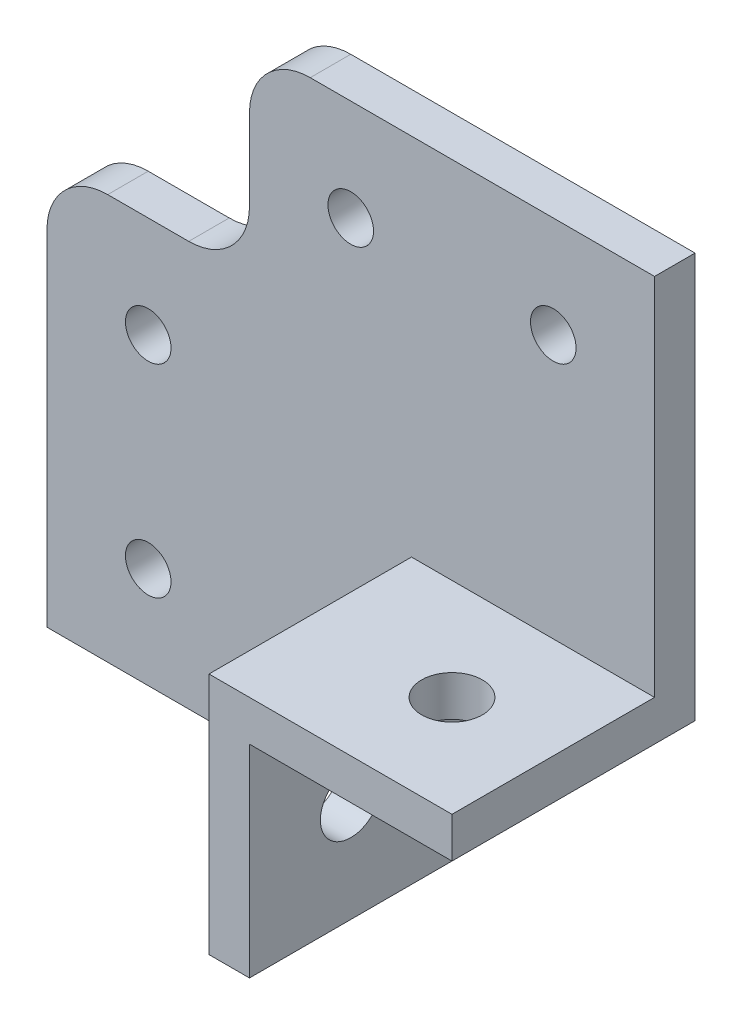
ISO-10303-21;
HEADER;
FILE_DESCRIPTION(('STEP AP214'),'2;1');
FILE_NAME('part.step','',(''),(''),'','','');
FILE_SCHEMA(('AUTOMOTIVE_DESIGN { 1 0 10303 214 1 1 1 1 }'));
ENDSEC;
DATA;
#1=APPLICATION_CONTEXT('core data for automotive mechanical design processes');
#2=APPLICATION_PROTOCOL_DEFINITION('international standard','automotive_design',2000,#1);
#3=PRODUCT_CONTEXT('',#1,'mechanical');
#4=PRODUCT('Part','Part','',(#3));
#5=PRODUCT_RELATED_PRODUCT_CATEGORY('part','',(#4));
#6=PRODUCT_DEFINITION_FORMATION('','',#4);
#7=PRODUCT_DEFINITION_CONTEXT('part definition',#1,'design');
#8=PRODUCT_DEFINITION('design','',#6,#7);
#9=PRODUCT_DEFINITION_SHAPE('','',#8);
#10=(LENGTH_UNIT() NAMED_UNIT(*) SI_UNIT(.MILLI.,.METRE.));
#11=(NAMED_UNIT(*) PLANE_ANGLE_UNIT() SI_UNIT($,.RADIAN.));
#12=(NAMED_UNIT(*) SI_UNIT($,.STERADIAN.) SOLID_ANGLE_UNIT());
#13=UNCERTAINTY_MEASURE_WITH_UNIT(LENGTH_MEASURE(1.E-05),#10,'distance_accuracy_value','');
#14=(GEOMETRIC_REPRESENTATION_CONTEXT(3) GLOBAL_UNCERTAINTY_ASSIGNED_CONTEXT((#13)) GLOBAL_UNIT_ASSIGNED_CONTEXT((#10,
#11,#12)) REPRESENTATION_CONTEXT('',''));
#15=CARTESIAN_POINT('',(0.,0.,0.));
#16=DIRECTION('',(0.,0.,1.));
#17=DIRECTION('',(1.,0.,0.));
#18=AXIS2_PLACEMENT_3D('',#15,#16,#17);
#19=CARTESIAN_POINT('',(20.,60.,4.));
#20=DIRECTION('',(0.,-1.,0.));
#21=DIRECTION('',(1.,0.,0.));
#22=AXIS2_PLACEMENT_3D('',#19,#20,#21);
#23=PLANE('',#22);
#24=DIRECTION('',(-1.,0.,0.));
#25=VECTOR('',#24,1.);
#26=CARTESIAN_POINT('',(20.,60.,0.));
#27=LINE('',#26,#25);
#28=CARTESIAN_POINT('',(20.,60.,0.));
#29=VERTEX_POINT('',#28);
#30=CARTESIAN_POINT('',(-14.,60.,0.));
#31=VERTEX_POINT('',#30);
#32=EDGE_CURVE('E228',#29,#31,#27,.T.);
#33=ORIENTED_EDGE('',*,*,#32,.T.);
#34=DIRECTION('',(0.,0.,-1.));
#35=VECTOR('',#34,1.);
#36=CARTESIAN_POINT('',(-14.,60.,4.));
#37=LINE('',#36,#35);
#38=CARTESIAN_POINT('',(-14.,60.,4.));
#39=VERTEX_POINT('',#38);
#40=EDGE_CURVE('E55',#31,#39,#37,.F.);
#41=ORIENTED_EDGE('',*,*,#40,.T.);
#42=DIRECTION('',(-1.,0.,0.));
#43=VECTOR('',#42,1.);
#44=CARTESIAN_POINT('',(20.,60.,4.));
#45=LINE('',#44,#43);
#46=CARTESIAN_POINT('',(20.,60.,4.));
#47=VERTEX_POINT('',#46);
#48=EDGE_CURVE('E243',#47,#39,#45,.T.);
#49=ORIENTED_EDGE('',*,*,#48,.F.);
#50=DIRECTION('',(0.,0.,-1.));
#51=VECTOR('',#50,1.);
#52=CARTESIAN_POINT('',(20.,60.,4.));
#53=LINE('',#52,#51);
#54=EDGE_CURVE('E146',#47,#29,#53,.T.);
#55=ORIENTED_EDGE('',*,*,#54,.T.);
#56=EDGE_LOOP('',(#33,#41,#49,#55));
#57=FACE_BOUND('',#56,.T.);
#58=ADVANCED_FACE('F32',(#57),#23,.F.);
#59=CARTESIAN_POINT('',(-20.,60.,4.));
#60=DIRECTION('',(1.,0.,0.));
#61=DIRECTION('',(0.,0.,-1.));
#62=AXIS2_PLACEMENT_3D('',#59,#60,#61);
#63=PLANE('',#62);
#64=DIRECTION('',(0.,-1.,0.));
#65=VECTOR('',#64,1.);
#66=CARTESIAN_POINT('',(-20.,60.,0.));
#67=LINE('',#66,#65);
#68=CARTESIAN_POINT('',(-20.,54.,0.));
#69=VERTEX_POINT('',#68);
#70=CARTESIAN_POINT('',(-20.,46.,0.));
#71=VERTEX_POINT('',#70);
#72=EDGE_CURVE('E217',#69,#71,#67,.T.);
#73=ORIENTED_EDGE('',*,*,#72,.T.);
#74=DIRECTION('',(0.,0.,-1.));
#75=VECTOR('',#74,1.);
#76=CARTESIAN_POINT('',(-20.,46.,4.));
#77=LINE('',#76,#75);
#78=CARTESIAN_POINT('',(-20.,46.,4.));
#79=VERTEX_POINT('',#78);
#80=EDGE_CURVE('E200',#71,#79,#77,.F.);
#81=ORIENTED_EDGE('',*,*,#80,.T.);
#82=DIRECTION('',(0.,-1.,0.));
#83=VECTOR('',#82,1.);
#84=CARTESIAN_POINT('',(-20.,60.,4.));
#85=LINE('',#84,#83);
#86=CARTESIAN_POINT('',(-20.,54.,4.));
#87=VERTEX_POINT('',#86);
#88=EDGE_CURVE('E235',#87,#79,#85,.T.);
#89=ORIENTED_EDGE('',*,*,#88,.F.);
#90=DIRECTION('',(0.,0.,-1.));
#91=VECTOR('',#90,1.);
#92=CARTESIAN_POINT('',(-20.,54.,4.));
#93=LINE('',#92,#91);
#94=EDGE_CURVE('E197',#87,#69,#93,.T.);
#95=ORIENTED_EDGE('',*,*,#94,.T.);
#96=EDGE_LOOP('',(#73,#81,#89,#95));
#97=FACE_BOUND('',#96,.T.);
#98=ADVANCED_FACE('F224',(#97),#63,.F.);
#99=CARTESIAN_POINT('',(-20.,40.,4.));
#100=DIRECTION('',(0.,-1.,0.));
#101=DIRECTION('',(1.,0.,0.));
#102=AXIS2_PLACEMENT_3D('',#99,#100,#101);
#103=PLANE('',#102);
#104=DIRECTION('',(-1.,0.,0.));
#105=VECTOR('',#104,1.);
#106=CARTESIAN_POINT('',(-20.,40.,4.));
#107=LINE('',#106,#105);
#108=CARTESIAN_POINT('',(-26.,40.,4.));
#109=VERTEX_POINT('',#108);
#110=CARTESIAN_POINT('',(-34.,40.,4.));
#111=VERTEX_POINT('',#110);
#112=EDGE_CURVE('E234',#109,#111,#107,.T.);
#113=ORIENTED_EDGE('',*,*,#112,.F.);
#114=DIRECTION('',(0.,0.,-1.));
#115=VECTOR('',#114,1.);
#116=CARTESIAN_POINT('',(-26.,40.,0.));
#117=LINE('',#116,#115);
#118=CARTESIAN_POINT('',(-26.,40.,0.));
#119=VERTEX_POINT('',#118);
#120=EDGE_CURVE('E193',#109,#119,#117,.T.);
#121=ORIENTED_EDGE('',*,*,#120,.T.);
#122=DIRECTION('',(-1.,0.,0.));
#123=VECTOR('',#122,1.);
#124=CARTESIAN_POINT('',(-20.,40.,0.));
#125=LINE('',#124,#123);
#126=CARTESIAN_POINT('',(-34.,40.,0.));
#127=VERTEX_POINT('',#126);
#128=EDGE_CURVE('E219',#119,#127,#125,.T.);
#129=ORIENTED_EDGE('',*,*,#128,.T.);
#130=DIRECTION('',(0.,0.,-1.));
#131=VECTOR('',#130,1.);
#132=CARTESIAN_POINT('',(-34.,40.,4.));
#133=LINE('',#132,#131);
#134=EDGE_CURVE('E191',#127,#111,#133,.F.);
#135=ORIENTED_EDGE('',*,*,#134,.T.);
#136=EDGE_LOOP('',(#113,#121,#129,#135));
#137=FACE_BOUND('',#136,.T.);
#138=ADVANCED_FACE('F237',(#137),#103,.F.);
#139=CARTESIAN_POINT('',(-40.,40.,4.));
#140=DIRECTION('',(1.,0.,0.));
#141=DIRECTION('',(0.,1.,0.));
#142=AXIS2_PLACEMENT_3D('',#139,#140,#141);
#143=PLANE('',#142);
#144=DIRECTION('',(0.,-1.,0.));
#145=VECTOR('',#144,1.);
#146=CARTESIAN_POINT('',(-40.,40.,4.));
#147=LINE('',#146,#145);
#148=CARTESIAN_POINT('',(-40.,34.,4.));
#149=VERTEX_POINT('',#148);
#150=CARTESIAN_POINT('',(-40.,0.,4.));
#151=VERTEX_POINT('',#150);
#152=EDGE_CURVE('E239',#149,#151,#147,.T.);
#153=ORIENTED_EDGE('',*,*,#152,.F.);
#154=DIRECTION('',(0.,0.,-1.));
#155=VECTOR('',#154,1.);
#156=CARTESIAN_POINT('',(-40.,34.,4.));
#157=LINE('',#156,#155);
#158=CARTESIAN_POINT('',(-40.,34.,0.));
#159=VERTEX_POINT('',#158);
#160=EDGE_CURVE('E210',#149,#159,#157,.T.);
#161=ORIENTED_EDGE('',*,*,#160,.T.);
#162=DIRECTION('',(0.,-1.,0.));
#163=VECTOR('',#162,1.);
#164=CARTESIAN_POINT('',(-40.,40.,0.));
#165=LINE('',#164,#163);
#166=CARTESIAN_POINT('',(-40.,0.,0.));
#167=VERTEX_POINT('',#166);
#168=EDGE_CURVE('E291',#159,#167,#165,.T.);
#169=ORIENTED_EDGE('',*,*,#168,.T.);
#170=DIRECTION('',(0.,0.,-1.));
#171=VECTOR('',#170,1.);
#172=CARTESIAN_POINT('',(-40.,0.,4.));
#173=LINE('',#172,#171);
#174=EDGE_CURVE('E194',#151,#167,#173,.T.);
#175=ORIENTED_EDGE('',*,*,#174,.F.);
#176=EDGE_LOOP('',(#153,#161,#169,#175));
#177=FACE_BOUND('',#176,.T.);
#178=ADVANCED_FACE('F297',(#177),#143,.F.);
#179=CARTESIAN_POINT('',(-40.,0.,4.));
#180=DIRECTION('',(0.,1.,0.));
#181=DIRECTION('',(0.,0.,1.));
#182=AXIS2_PLACEMENT_3D('',#179,#180,#181);
#183=PLANE('',#182);
#184=DIRECTION('',(1.,0.,0.));
#185=VECTOR('',#184,1.);
#186=CARTESIAN_POINT('',(-40.,0.,0.));
#187=LINE('',#186,#185);
#188=CARTESIAN_POINT('',(0.,0.,0.));
#189=VERTEX_POINT('',#188);
#190=EDGE_CURVE('E288',#167,#189,#187,.T.);
#191=ORIENTED_EDGE('',*,*,#190,.T.);
#192=DIRECTION('',(0.,0.,-1.));
#193=VECTOR('',#192,1.);
#194=CARTESIAN_POINT('',(0.,0.,4.));
#195=LINE('',#194,#193);
#196=CARTESIAN_POINT('',(0.,0.,24.));
#197=VERTEX_POINT('',#196);
#198=EDGE_CURVE('E278',#197,#189,#195,.T.);
#199=ORIENTED_EDGE('',*,*,#198,.F.);
#200=DIRECTION('',(1.,0.,0.));
#201=VECTOR('',#200,1.);
#202=CARTESIAN_POINT('',(-4.,0.,24.));
#203=LINE('',#202,#201);
#204=CARTESIAN_POINT('',(-4.,0.,24.));
#205=VERTEX_POINT('',#204);
#206=EDGE_CURVE('E175',#205,#197,#203,.T.);
#207=ORIENTED_EDGE('',*,*,#206,.F.);
#208=DIRECTION('',(0.,0.,-1.));
#209=VECTOR('',#208,1.);
#210=CARTESIAN_POINT('',(-4.,0.,24.));
#211=LINE('',#210,#209);
#212=CARTESIAN_POINT('',(-4.,0.,4.));
#213=VERTEX_POINT('',#212);
#214=EDGE_CURVE('E178',#205,#213,#211,.T.);
#215=ORIENTED_EDGE('',*,*,#214,.T.);
#216=DIRECTION('',(1.,0.,0.));
#217=VECTOR('',#216,1.);
#218=CARTESIAN_POINT('',(-40.,0.,4.));
#219=LINE('',#218,#217);
#220=EDGE_CURVE('E241',#151,#213,#219,.T.);
#221=ORIENTED_EDGE('',*,*,#220,.F.);
#222=ORIENTED_EDGE('',*,*,#174,.T.);
#223=EDGE_LOOP('',(#191,#199,#207,#215,#221,#222));
#224=FACE_BOUND('',#223,.T.);
#225=ADVANCED_FACE('F287',(#224),#183,.F.);
#226=CARTESIAN_POINT('',(0.,0.,4.));
#227=DIRECTION('',(-1.,0.,0.));
#228=DIRECTION('',(0.,0.,1.));
#229=AXIS2_PLACEMENT_3D('',#226,#227,#228);
#230=PLANE('',#229);
#231=CARTESIAN_POINT('',(0.,10.,14.));
#232=DIRECTION('',(-1.,0.,0.));
#233=DIRECTION('',(0.,0.,1.));
#234=AXIS2_PLACEMENT_3D('',#231,#232,#233);
#235=CIRCLE('',#234,3.);
#236=CARTESIAN_POINT('',(0.,10.,17.));
#237=VERTEX_POINT('',#236);
#238=EDGE_CURVE('E169',#237,#237,#235,.T.);
#239=ORIENTED_EDGE('',*,*,#238,.T.);
#240=EDGE_LOOP('',(#239));
#241=FACE_BOUND('',#240,.T.);
#242=DIRECTION('',(0.,1.,0.));
#243=VECTOR('',#242,1.);
#244=CARTESIAN_POINT('',(0.,0.,0.));
#245=LINE('',#244,#243);
#246=CARTESIAN_POINT('',(0.,20.,0.));
#247=VERTEX_POINT('',#246);
#248=EDGE_CURVE('E274',#189,#247,#245,.T.);
#249=ORIENTED_EDGE('',*,*,#248,.T.);
#250=DIRECTION('',(0.,0.,-1.));
#251=VECTOR('',#250,1.);
#252=CARTESIAN_POINT('',(0.,20.,4.));
#253=LINE('',#252,#251);
#254=CARTESIAN_POINT('',(0.,20.,24.));
#255=VERTEX_POINT('',#254);
#256=EDGE_CURVE('E145',#255,#247,#253,.T.);
#257=ORIENTED_EDGE('',*,*,#256,.F.);
#258=DIRECTION('',(0.,1.,0.));
#259=VECTOR('',#258,1.);
#260=CARTESIAN_POINT('',(0.,0.,24.));
#261=LINE('',#260,#259);
#262=EDGE_CURVE('E162',#197,#255,#261,.T.);
#263=ORIENTED_EDGE('',*,*,#262,.F.);
#264=ORIENTED_EDGE('',*,*,#198,.T.);
#265=EDGE_LOOP('',(#249,#257,#263,#264));
#266=FACE_BOUND('',#265,.T.);
#267=ADVANCED_FACE('F304',(#241,#266),#230,.F.);
#268=CARTESIAN_POINT('',(0.,20.,4.));
#269=DIRECTION('',(0.,1.,0.));
#270=DIRECTION('',(0.,0.,1.));
#271=AXIS2_PLACEMENT_3D('',#268,#269,#270);
#272=PLANE('',#271);
#273=CARTESIAN_POINT('',(10.,20.,14.));
#274=DIRECTION('',(0.,1.,0.));
#275=DIRECTION('',(0.,0.,1.));
#276=AXIS2_PLACEMENT_3D('',#273,#274,#275);
#277=CIRCLE('',#276,3.);
#278=CARTESIAN_POINT('',(10.,20.,17.));
#279=VERTEX_POINT('',#278);
#280=EDGE_CURVE('E510',#279,#279,#277,.T.);
#281=ORIENTED_EDGE('',*,*,#280,.T.);
#282=EDGE_LOOP('',(#281));
#283=FACE_BOUND('',#282,.T.);
#284=DIRECTION('',(1.,0.,0.));
#285=VECTOR('',#284,1.);
#286=CARTESIAN_POINT('',(0.,20.,0.));
#287=LINE('',#286,#285);
#288=CARTESIAN_POINT('',(20.,20.,0.));
#289=VERTEX_POINT('',#288);
#290=EDGE_CURVE('E142',#247,#289,#287,.T.);
#291=ORIENTED_EDGE('',*,*,#290,.T.);
#292=DIRECTION('',(0.,0.,-1.));
#293=VECTOR('',#292,1.);
#294=CARTESIAN_POINT('',(20.,20.,4.));
#295=LINE('',#294,#293);
#296=CARTESIAN_POINT('',(20.,20.,24.));
#297=VERTEX_POINT('',#296);
#298=EDGE_CURVE('E135',#297,#289,#295,.T.);
#299=ORIENTED_EDGE('',*,*,#298,.F.);
#300=DIRECTION('',(1.,0.,0.));
#301=VECTOR('',#300,1.);
#302=CARTESIAN_POINT('',(0.,20.,24.));
#303=LINE('',#302,#301);
#304=EDGE_CURVE('E140',#255,#297,#303,.T.);
#305=ORIENTED_EDGE('',*,*,#304,.F.);
#306=ORIENTED_EDGE('',*,*,#256,.T.);
#307=EDGE_LOOP('',(#291,#299,#305,#306));
#308=FACE_BOUND('',#307,.T.);
#309=ADVANCED_FACE('F137',(#283,#308),#272,.F.);
#310=CARTESIAN_POINT('',(20.,20.,4.));
#311=DIRECTION('',(-1.,0.,0.));
#312=DIRECTION('',(0.,0.,1.));
#313=AXIS2_PLACEMENT_3D('',#310,#311,#312);
#314=PLANE('',#313);
#315=DIRECTION('',(0.,1.,0.));
#316=VECTOR('',#315,1.);
#317=CARTESIAN_POINT('',(20.,20.,0.));
#318=LINE('',#317,#316);
#319=EDGE_CURVE('E269',#289,#29,#318,.T.);
#320=ORIENTED_EDGE('',*,*,#319,.T.);
#321=ORIENTED_EDGE('',*,*,#54,.F.);
#322=DIRECTION('',(0.,1.,0.));
#323=VECTOR('',#322,1.);
#324=CARTESIAN_POINT('',(20.,20.,4.));
#325=LINE('',#324,#323);
#326=CARTESIAN_POINT('',(20.,24.,4.));
#327=VERTEX_POINT('',#326);
#328=EDGE_CURVE('E253',#327,#47,#325,.T.);
#329=ORIENTED_EDGE('',*,*,#328,.F.);
#330=DIRECTION('',(0.,0.,-1.));
#331=VECTOR('',#330,1.);
#332=CARTESIAN_POINT('',(20.,24.,24.));
#333=LINE('',#332,#331);
#334=CARTESIAN_POINT('',(20.,24.,24.));
#335=VERTEX_POINT('',#334);
#336=EDGE_CURVE('E153',#335,#327,#333,.T.);
#337=ORIENTED_EDGE('',*,*,#336,.F.);
#338=DIRECTION('',(0.,1.,0.));
#339=VECTOR('',#338,1.);
#340=CARTESIAN_POINT('',(20.,20.,24.));
#341=LINE('',#340,#339);
#342=EDGE_CURVE('E149',#297,#335,#341,.T.);
#343=ORIENTED_EDGE('',*,*,#342,.F.);
#344=ORIENTED_EDGE('',*,*,#298,.T.);
#345=EDGE_LOOP('',(#320,#321,#329,#337,#343,#344));
#346=FACE_BOUND('',#345,.T.);
#347=ADVANCED_FACE('F150',(#346),#314,.F.);
#348=CARTESIAN_POINT('',(0.,0.,4.));
#349=DIRECTION('',(0.,0.,1.));
#350=DIRECTION('',(1.,0.,0.));
#351=AXIS2_PLACEMENT_3D('',#348,#349,#350);
#352=PLANE('',#351);
#353=CARTESIAN_POINT('',(-30.,10.,4.));
#354=DIRECTION('',(0.,0.,1.));
#355=DIRECTION('',(1.,0.,0.));
#356=AXIS2_PLACEMENT_3D('',#353,#354,#355);
#357=CIRCLE('',#356,2.25);
#358=CARTESIAN_POINT('',(-27.75,10.,4.));
#359=VERTEX_POINT('',#358);
#360=EDGE_CURVE('E537',#359,#359,#357,.T.);
#361=ORIENTED_EDGE('',*,*,#360,.F.);
#362=EDGE_LOOP('',(#361));
#363=FACE_BOUND('',#362,.T.);
#364=CARTESIAN_POINT('',(-30.,30.,4.));
#365=DIRECTION('',(0.,0.,1.));
#366=DIRECTION('',(1.,0.,0.));
#367=AXIS2_PLACEMENT_3D('',#364,#365,#366);
#368=CIRCLE('',#367,2.25);
#369=CARTESIAN_POINT('',(-27.75,30.,4.));
#370=VERTEX_POINT('',#369);
#371=EDGE_CURVE('E531',#370,#370,#368,.T.);
#372=ORIENTED_EDGE('',*,*,#371,.F.);
#373=EDGE_LOOP('',(#372));
#374=FACE_BOUND('',#373,.T.);
#375=CARTESIAN_POINT('',(-10.,50.,4.));
#376=DIRECTION('',(0.,0.,1.));
#377=DIRECTION('',(1.,0.,0.));
#378=AXIS2_PLACEMENT_3D('',#375,#376,#377);
#379=CIRCLE('',#378,2.25);
#380=CARTESIAN_POINT('',(-7.75,50.,4.));
#381=VERTEX_POINT('',#380);
#382=EDGE_CURVE('E525',#381,#381,#379,.T.);
#383=ORIENTED_EDGE('',*,*,#382,.F.);
#384=EDGE_LOOP('',(#383));
#385=FACE_BOUND('',#384,.T.);
#386=CARTESIAN_POINT('',(10.,50.,4.));
#387=DIRECTION('',(0.,0.,1.));
#388=DIRECTION('',(1.,0.,0.));
#389=AXIS2_PLACEMENT_3D('',#386,#387,#388);
#390=CIRCLE('',#389,2.25);
#391=CARTESIAN_POINT('',(12.25,50.,4.));
#392=VERTEX_POINT('',#391);
#393=EDGE_CURVE('E519',#392,#392,#390,.T.);
#394=ORIENTED_EDGE('',*,*,#393,.F.);
#395=EDGE_LOOP('',(#394));
#396=FACE_BOUND('',#395,.T.);
#397=ORIENTED_EDGE('',*,*,#48,.T.);
#398=CARTESIAN_POINT('',(-14.,54.,4.));
#399=DIRECTION('',(0.,0.,1.));
#400=DIRECTION('',(1.,0.,0.));
#401=AXIS2_PLACEMENT_3D('',#398,#399,#400);
#402=CIRCLE('',#401,6.);
#403=EDGE_CURVE('E208',#39,#87,#402,.T.);
#404=ORIENTED_EDGE('',*,*,#403,.T.);
#405=ORIENTED_EDGE('',*,*,#88,.T.);
#406=CARTESIAN_POINT('',(-26.,46.,4.));
#407=DIRECTION('',(0.,0.,1.));
#408=DIRECTION('',(1.,0.,0.));
#409=AXIS2_PLACEMENT_3D('',#406,#407,#408);
#410=CIRCLE('',#409,6.);
#411=EDGE_CURVE('E11',#79,#109,#410,.F.);
#412=ORIENTED_EDGE('',*,*,#411,.T.);
#413=ORIENTED_EDGE('',*,*,#112,.T.);
#414=CARTESIAN_POINT('',(-34.,34.,4.));
#415=DIRECTION('',(0.,0.,1.));
#416=DIRECTION('',(1.,0.,0.));
#417=AXIS2_PLACEMENT_3D('',#414,#415,#416);
#418=CIRCLE('',#417,6.);
#419=EDGE_CURVE('E47',#111,#149,#418,.T.);
#420=ORIENTED_EDGE('',*,*,#419,.T.);
#421=ORIENTED_EDGE('',*,*,#152,.T.);
#422=ORIENTED_EDGE('',*,*,#220,.T.);
#423=DIRECTION('',(0.,-1.,0.));
#424=VECTOR('',#423,1.);
#425=CARTESIAN_POINT('',(-4.,24.,4.));
#426=LINE('',#425,#424);
#427=CARTESIAN_POINT('',(-4.,24.,4.));
#428=VERTEX_POINT('',#427);
#429=EDGE_CURVE('E163',#428,#213,#426,.T.);
#430=ORIENTED_EDGE('',*,*,#429,.F.);
#431=DIRECTION('',(-1.,0.,0.));
#432=VECTOR('',#431,1.);
#433=CARTESIAN_POINT('',(20.,24.,4.));
#434=LINE('',#433,#432);
#435=EDGE_CURVE('E166',#327,#428,#434,.T.);
#436=ORIENTED_EDGE('',*,*,#435,.F.);
#437=ORIENTED_EDGE('',*,*,#328,.T.);
#438=EDGE_LOOP('',(#397,#404,#405,#412,#413,#420,#421,#422,#430,#436,#437));
#439=FACE_BOUND('',#438,.T.);
#440=ADVANCED_FACE('F233',(#363,#374,#385,#396,#439),#352,.T.);
#441=CARTESIAN_POINT('',(0.,0.,0.));
#442=DIRECTION('',(0.,0.,1.));
#443=DIRECTION('',(1.,0.,0.));
#444=AXIS2_PLACEMENT_3D('',#441,#442,#443);
#445=PLANE('',#444);
#446=CARTESIAN_POINT('',(-30.,10.,0.));
#447=DIRECTION('',(0.,0.,1.));
#448=DIRECTION('',(1.,0.,0.));
#449=AXIS2_PLACEMENT_3D('',#446,#447,#448);
#450=CIRCLE('',#449,2.25);
#451=CARTESIAN_POINT('',(-27.75,10.,0.));
#452=VERTEX_POINT('',#451);
#453=EDGE_CURVE('E534',#452,#452,#450,.T.);
#454=ORIENTED_EDGE('',*,*,#453,.T.);
#455=EDGE_LOOP('',(#454));
#456=FACE_BOUND('',#455,.T.);
#457=CARTESIAN_POINT('',(-30.,30.,0.));
#458=DIRECTION('',(0.,0.,1.));
#459=DIRECTION('',(1.,0.,0.));
#460=AXIS2_PLACEMENT_3D('',#457,#458,#459);
#461=CIRCLE('',#460,2.25);
#462=CARTESIAN_POINT('',(-27.75,30.,0.));
#463=VERTEX_POINT('',#462);
#464=EDGE_CURVE('E528',#463,#463,#461,.T.);
#465=ORIENTED_EDGE('',*,*,#464,.T.);
#466=EDGE_LOOP('',(#465));
#467=FACE_BOUND('',#466,.T.);
#468=CARTESIAN_POINT('',(-10.,50.,0.));
#469=DIRECTION('',(0.,0.,1.));
#470=DIRECTION('',(1.,0.,0.));
#471=AXIS2_PLACEMENT_3D('',#468,#469,#470);
#472=CIRCLE('',#471,2.25);
#473=CARTESIAN_POINT('',(-7.75,50.,0.));
#474=VERTEX_POINT('',#473);
#475=EDGE_CURVE('E522',#474,#474,#472,.T.);
#476=ORIENTED_EDGE('',*,*,#475,.T.);
#477=EDGE_LOOP('',(#476));
#478=FACE_BOUND('',#477,.T.);
#479=CARTESIAN_POINT('',(10.,50.,0.));
#480=DIRECTION('',(0.,0.,1.));
#481=DIRECTION('',(1.,0.,0.));
#482=AXIS2_PLACEMENT_3D('',#479,#480,#481);
#483=CIRCLE('',#482,2.25);
#484=CARTESIAN_POINT('',(12.25,50.,0.));
#485=VERTEX_POINT('',#484);
#486=EDGE_CURVE('E518',#485,#485,#483,.T.);
#487=ORIENTED_EDGE('',*,*,#486,.T.);
#488=EDGE_LOOP('',(#487));
#489=FACE_BOUND('',#488,.T.);
#490=ORIENTED_EDGE('',*,*,#72,.F.);
#491=CARTESIAN_POINT('',(-14.,54.,0.));
#492=DIRECTION('',(0.,0.,1.));
#493=DIRECTION('',(1.,0.,0.));
#494=AXIS2_PLACEMENT_3D('',#491,#492,#493);
#495=CIRCLE('',#494,6.);
#496=EDGE_CURVE('E204',#69,#31,#495,.F.);
#497=ORIENTED_EDGE('',*,*,#496,.T.);
#498=ORIENTED_EDGE('',*,*,#32,.F.);
#499=ORIENTED_EDGE('',*,*,#319,.F.);
#500=ORIENTED_EDGE('',*,*,#290,.F.);
#501=ORIENTED_EDGE('',*,*,#248,.F.);
#502=ORIENTED_EDGE('',*,*,#190,.F.);
#503=ORIENTED_EDGE('',*,*,#168,.F.);
#504=CARTESIAN_POINT('',(-34.,34.,0.));
#505=DIRECTION('',(0.,0.,1.));
#506=DIRECTION('',(1.,0.,0.));
#507=AXIS2_PLACEMENT_3D('',#504,#505,#506);
#508=CIRCLE('',#507,6.);
#509=EDGE_CURVE('E202',#159,#127,#508,.F.);
#510=ORIENTED_EDGE('',*,*,#509,.T.);
#511=ORIENTED_EDGE('',*,*,#128,.F.);
#512=CARTESIAN_POINT('',(-26.,46.,0.));
#513=DIRECTION('',(0.,0.,1.));
#514=DIRECTION('',(1.,0.,0.));
#515=AXIS2_PLACEMENT_3D('',#512,#513,#514);
#516=CIRCLE('',#515,6.);
#517=EDGE_CURVE('E40',#119,#71,#516,.T.);
#518=ORIENTED_EDGE('',*,*,#517,.T.);
#519=EDGE_LOOP('',(#490,#497,#498,#499,#500,#501,#502,#503,#510,#511,#518));
#520=FACE_BOUND('',#519,.T.);
#521=ADVANCED_FACE('F216',(#456,#467,#478,#489,#520),#445,.F.);
#522=CARTESIAN_POINT('',(20.,24.,24.));
#523=DIRECTION('',(0.,-1.,0.));
#524=DIRECTION('',(1.,0.,0.));
#525=AXIS2_PLACEMENT_3D('',#522,#523,#524);
#526=PLANE('',#525);
#527=CARTESIAN_POINT('',(10.,24.,14.));
#528=DIRECTION('',(0.,1.,0.));
#529=DIRECTION('',(-1.,0.,0.));
#530=AXIS2_PLACEMENT_3D('',#527,#528,#529);
#531=CIRCLE('',#530,3.);
#532=CARTESIAN_POINT('',(7.,24.,14.));
#533=VERTEX_POINT('',#532);
#534=EDGE_CURVE('E513',#533,#533,#531,.T.);
#535=ORIENTED_EDGE('',*,*,#534,.F.);
#536=EDGE_LOOP('',(#535));
#537=FACE_BOUND('',#536,.T.);
#538=ORIENTED_EDGE('',*,*,#435,.T.);
#539=DIRECTION('',(0.,0.,-1.));
#540=VECTOR('',#539,1.);
#541=CARTESIAN_POINT('',(-4.,24.,24.));
#542=LINE('',#541,#540);
#543=CARTESIAN_POINT('',(-4.,24.,24.));
#544=VERTEX_POINT('',#543);
#545=EDGE_CURVE('E181',#544,#428,#542,.T.);
#546=ORIENTED_EDGE('',*,*,#545,.F.);
#547=DIRECTION('',(-1.,0.,0.));
#548=VECTOR('',#547,1.);
#549=CARTESIAN_POINT('',(20.,24.,24.));
#550=LINE('',#549,#548);
#551=EDGE_CURVE('E156',#335,#544,#550,.T.);
#552=ORIENTED_EDGE('',*,*,#551,.F.);
#553=ORIENTED_EDGE('',*,*,#336,.T.);
#554=EDGE_LOOP('',(#538,#546,#552,#553));
#555=FACE_BOUND('',#554,.T.);
#556=ADVANCED_FACE('F266',(#537,#555),#526,.F.);
#557=CARTESIAN_POINT('',(-4.,24.,24.));
#558=DIRECTION('',(1.,0.,0.));
#559=DIRECTION('',(0.,1.,0.));
#560=AXIS2_PLACEMENT_3D('',#557,#558,#559);
#561=PLANE('',#560);
#562=CARTESIAN_POINT('',(-4.,10.,14.));
#563=DIRECTION('',(-1.,0.,0.));
#564=DIRECTION('',(0.,-1.,0.));
#565=AXIS2_PLACEMENT_3D('',#562,#563,#564);
#566=CIRCLE('',#565,3.);
#567=CARTESIAN_POINT('',(-4.,7.,14.));
#568=VERTEX_POINT('',#567);
#569=EDGE_CURVE('E508',#568,#568,#566,.T.);
#570=ORIENTED_EDGE('',*,*,#569,.F.);
#571=EDGE_LOOP('',(#570));
#572=FACE_BOUND('',#571,.T.);
#573=ORIENTED_EDGE('',*,*,#429,.T.);
#574=ORIENTED_EDGE('',*,*,#214,.F.);
#575=DIRECTION('',(0.,-1.,0.));
#576=VECTOR('',#575,1.);
#577=CARTESIAN_POINT('',(-4.,24.,24.));
#578=LINE('',#577,#576);
#579=EDGE_CURVE('E173',#544,#205,#578,.T.);
#580=ORIENTED_EDGE('',*,*,#579,.F.);
#581=ORIENTED_EDGE('',*,*,#545,.T.);
#582=EDGE_LOOP('',(#573,#574,#580,#581));
#583=FACE_BOUND('',#582,.T.);
#584=ADVANCED_FACE('F264',(#572,#583),#561,.F.);
#585=CARTESIAN_POINT('',(0.,0.,24.));
#586=DIRECTION('',(0.,0.,1.));
#587=DIRECTION('',(1.,0.,0.));
#588=AXIS2_PLACEMENT_3D('',#585,#586,#587);
#589=PLANE('',#588);
#590=ORIENTED_EDGE('',*,*,#304,.T.);
#591=ORIENTED_EDGE('',*,*,#342,.T.);
#592=ORIENTED_EDGE('',*,*,#551,.T.);
#593=ORIENTED_EDGE('',*,*,#579,.T.);
#594=ORIENTED_EDGE('',*,*,#206,.T.);
#595=ORIENTED_EDGE('',*,*,#262,.T.);
#596=EDGE_LOOP('',(#590,#591,#592,#593,#594,#595));
#597=FACE_BOUND('',#596,.T.);
#598=ADVANCED_FACE('F159',(#597),#589,.T.);
#599=CARTESIAN_POINT('',(20.00005,10.,14.));
#600=DIRECTION('',(-1.,0.,0.));
#601=DIRECTION('',(0.,-1.,0.));
#602=AXIS2_PLACEMENT_3D('',#599,#600,#601);
#603=CYLINDRICAL_SURFACE('',#602,3.);
#604=ORIENTED_EDGE('',*,*,#569,.T.);
#605=EDGE_LOOP('',(#604));
#606=FACE_BOUND('',#605,.T.);
#607=ORIENTED_EDGE('',*,*,#238,.F.);
#608=EDGE_LOOP('',(#607));
#609=FACE_BOUND('',#608,.T.);
#610=ADVANCED_FACE('F426',(#606,#609),#603,.F.);
#611=CARTESIAN_POINT('',(10.,-5.00000000049072E-05,14.));
#612=DIRECTION('',(0.,1.,0.));
#613=DIRECTION('',(-1.,0.,0.));
#614=AXIS2_PLACEMENT_3D('',#611,#612,#613);
#615=CYLINDRICAL_SURFACE('',#614,3.);
#616=ORIENTED_EDGE('',*,*,#534,.T.);
#617=EDGE_LOOP('',(#616));
#618=FACE_BOUND('',#617,.T.);
#619=ORIENTED_EDGE('',*,*,#280,.F.);
#620=EDGE_LOOP('',(#619));
#621=FACE_BOUND('',#620,.T.);
#622=ADVANCED_FACE('F416',(#618,#621),#615,.F.);
#623=CARTESIAN_POINT('',(10.,50.,0.));
#624=DIRECTION('',(0.,0.,1.));
#625=DIRECTION('',(1.,0.,0.));
#626=AXIS2_PLACEMENT_3D('',#623,#624,#625);
#627=CYLINDRICAL_SURFACE('',#626,2.25);
#628=ORIENTED_EDGE('',*,*,#486,.F.);
#629=EDGE_LOOP('',(#628));
#630=FACE_BOUND('',#629,.T.);
#631=ORIENTED_EDGE('',*,*,#393,.T.);
#632=EDGE_LOOP('',(#631));
#633=FACE_BOUND('',#632,.T.);
#634=ADVANCED_FACE('F406',(#630,#633),#627,.F.);
#635=CARTESIAN_POINT('',(-10.,50.,0.));
#636=DIRECTION('',(0.,0.,1.));
#637=DIRECTION('',(1.,0.,0.));
#638=AXIS2_PLACEMENT_3D('',#635,#636,#637);
#639=CYLINDRICAL_SURFACE('',#638,2.25);
#640=ORIENTED_EDGE('',*,*,#475,.F.);
#641=EDGE_LOOP('',(#640));
#642=FACE_BOUND('',#641,.T.);
#643=ORIENTED_EDGE('',*,*,#382,.T.);
#644=EDGE_LOOP('',(#643));
#645=FACE_BOUND('',#644,.T.);
#646=ADVANCED_FACE('F396',(#642,#645),#639,.F.);
#647=CARTESIAN_POINT('',(-30.,30.,0.));
#648=DIRECTION('',(0.,0.,1.));
#649=DIRECTION('',(1.,0.,0.));
#650=AXIS2_PLACEMENT_3D('',#647,#648,#649);
#651=CYLINDRICAL_SURFACE('',#650,2.25);
#652=ORIENTED_EDGE('',*,*,#464,.F.);
#653=EDGE_LOOP('',(#652));
#654=FACE_BOUND('',#653,.T.);
#655=ORIENTED_EDGE('',*,*,#371,.T.);
#656=EDGE_LOOP('',(#655));
#657=FACE_BOUND('',#656,.T.);
#658=ADVANCED_FACE('F386',(#654,#657),#651,.F.);
#659=CARTESIAN_POINT('',(-30.,10.,0.));
#660=DIRECTION('',(0.,0.,1.));
#661=DIRECTION('',(1.,0.,0.));
#662=AXIS2_PLACEMENT_3D('',#659,#660,#661);
#663=CYLINDRICAL_SURFACE('',#662,2.25);
#664=ORIENTED_EDGE('',*,*,#453,.F.);
#665=EDGE_LOOP('',(#664));
#666=FACE_BOUND('',#665,.T.);
#667=ORIENTED_EDGE('',*,*,#360,.T.);
#668=EDGE_LOOP('',(#667));
#669=FACE_BOUND('',#668,.T.);
#670=ADVANCED_FACE('F316',(#666,#669),#663,.F.);
#671=CARTESIAN_POINT('',(-26.,46.,4.));
#672=DIRECTION('',(0.,0.,1.));
#673=DIRECTION('',(1.,0.,0.));
#674=AXIS2_PLACEMENT_3D('',#671,#672,#673);
#675=CYLINDRICAL_SURFACE('',#674,6.);
#676=ORIENTED_EDGE('',*,*,#411,.F.);
#677=ORIENTED_EDGE('',*,*,#80,.F.);
#678=ORIENTED_EDGE('',*,*,#517,.F.);
#679=ORIENTED_EDGE('',*,*,#120,.F.);
#680=EDGE_LOOP('',(#676,#677,#678,#679));
#681=FACE_BOUND('',#680,.T.);
#682=ADVANCED_FACE('F231',(#681),#675,.F.);
#683=CARTESIAN_POINT('',(-14.,54.,4.));
#684=DIRECTION('',(0.,0.,-1.));
#685=DIRECTION('',(-1.,0.,0.));
#686=AXIS2_PLACEMENT_3D('',#683,#684,#685);
#687=CYLINDRICAL_SURFACE('',#686,6.);
#688=ORIENTED_EDGE('',*,*,#403,.F.);
#689=ORIENTED_EDGE('',*,*,#40,.F.);
#690=ORIENTED_EDGE('',*,*,#496,.F.);
#691=ORIENTED_EDGE('',*,*,#94,.F.);
#692=EDGE_LOOP('',(#688,#689,#690,#691));
#693=FACE_BOUND('',#692,.T.);
#694=ADVANCED_FACE('F315',(#693),#687,.T.);
#695=CARTESIAN_POINT('',(-34.,34.,4.));
#696=DIRECTION('',(0.,0.,-1.));
#697=DIRECTION('',(-1.,0.,0.));
#698=AXIS2_PLACEMENT_3D('',#695,#696,#697);
#699=CYLINDRICAL_SURFACE('',#698,6.);
#700=ORIENTED_EDGE('',*,*,#419,.F.);
#701=ORIENTED_EDGE('',*,*,#134,.F.);
#702=ORIENTED_EDGE('',*,*,#509,.F.);
#703=ORIENTED_EDGE('',*,*,#160,.F.);
#704=EDGE_LOOP('',(#700,#701,#702,#703));
#705=FACE_BOUND('',#704,.T.);
#706=ADVANCED_FACE('F34',(#705),#699,.T.);
#707=CLOSED_SHELL('',(#58,#98,#138,#178,#225,#267,#309,#347,#440,#521,#556,#584,#598,#610,#622,
#634,#646,#658,#670,#682,#694,#706));
#708=MANIFOLD_SOLID_BREP('B2',#707);
#709=ADVANCED_BREP_SHAPE_REPRESENTATION('',(#18,#708),#14);
#710=SHAPE_DEFINITION_REPRESENTATION(#9,#709);
ENDSEC;
END-ISO-10303-21;
